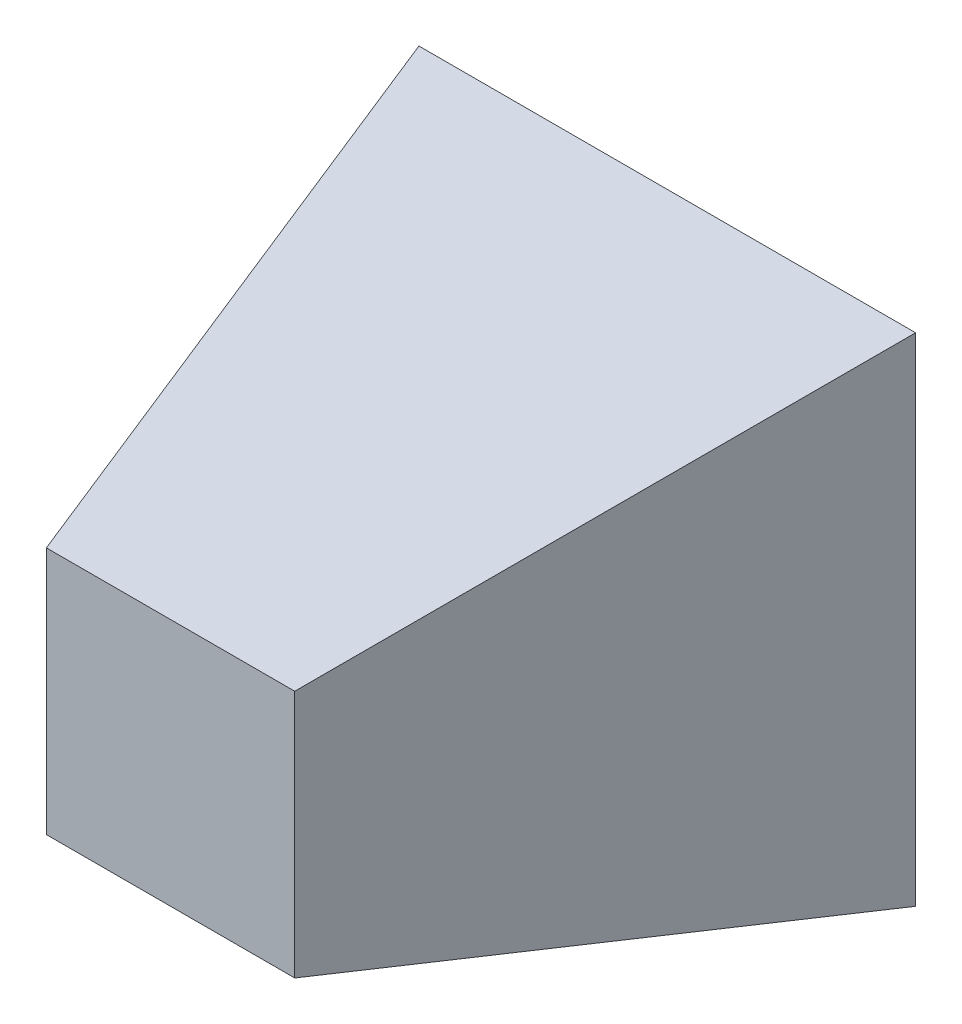
ISO-10303-21;
HEADER;
FILE_DESCRIPTION(('STEP AP214'),'2;1');
FILE_NAME('part.step','',(''),(''),'','','');
FILE_SCHEMA(('AUTOMOTIVE_DESIGN { 1 0 10303 214 1 1 1 1 }'));
ENDSEC;
DATA;
#1=APPLICATION_CONTEXT('core data for automotive mechanical design processes');
#2=APPLICATION_PROTOCOL_DEFINITION('international standard','automotive_design',2000,#1);
#3=PRODUCT_CONTEXT('',#1,'mechanical');
#4=PRODUCT('Part','Part','',(#3));
#5=PRODUCT_RELATED_PRODUCT_CATEGORY('part','',(#4));
#6=PRODUCT_DEFINITION_FORMATION('','',#4);
#7=PRODUCT_DEFINITION_CONTEXT('part definition',#1,'design');
#8=PRODUCT_DEFINITION('design','',#6,#7);
#9=PRODUCT_DEFINITION_SHAPE('','',#8);
#10=(LENGTH_UNIT() NAMED_UNIT(*) SI_UNIT(.MILLI.,.METRE.));
#11=(NAMED_UNIT(*) PLANE_ANGLE_UNIT() SI_UNIT($,.RADIAN.));
#12=(NAMED_UNIT(*) SI_UNIT($,.STERADIAN.) SOLID_ANGLE_UNIT());
#13=UNCERTAINTY_MEASURE_WITH_UNIT(LENGTH_MEASURE(1.E-05),#10,'distance_accuracy_value','');
#14=(GEOMETRIC_REPRESENTATION_CONTEXT(3) GLOBAL_UNCERTAINTY_ASSIGNED_CONTEXT((#13)) GLOBAL_UNIT_ASSIGNED_CONTEXT((#10,
#11,#12)) REPRESENTATION_CONTEXT('',''));
#15=CARTESIAN_POINT('',(0.,0.,0.));
#16=DIRECTION('',(0.,0.,1.));
#17=DIRECTION('',(1.,0.,0.));
#18=AXIS2_PLACEMENT_3D('',#15,#16,#17);
#19=CARTESIAN_POINT('',(0.,0.,100.));
#20=DIRECTION('',(0.,0.,1.));
#21=DIRECTION('',(1.,0.,0.));
#22=AXIS2_PLACEMENT_3D('',#19,#20,#21);
#23=PLANE('',#22);
#24=DIRECTION('',(0.,1.,0.));
#25=VECTOR('',#24,1.);
#26=CARTESIAN_POINT('',(25.,25.,100.));
#27=LINE('',#26,#25);
#28=CARTESIAN_POINT('',(25.,-25.,100.));
#29=VERTEX_POINT('',#28);
#30=CARTESIAN_POINT('',(25.,25.,100.));
#31=VERTEX_POINT('',#30);
#32=EDGE_CURVE('E173',#29,#31,#27,.T.);
#33=ORIENTED_EDGE('',*,*,#32,.T.);
#34=DIRECTION('',(-1.,0.,0.));
#35=VECTOR('',#34,1.);
#36=CARTESIAN_POINT('',(-25.,25.,100.));
#37=LINE('',#36,#35);
#38=CARTESIAN_POINT('',(-25.,25.,100.));
#39=VERTEX_POINT('',#38);
#40=EDGE_CURVE('E12',#31,#39,#37,.T.);
#41=ORIENTED_EDGE('',*,*,#40,.T.);
#42=DIRECTION('',(0.,-1.,0.));
#43=VECTOR('',#42,1.);
#44=CARTESIAN_POINT('',(-25.,25.,100.));
#45=LINE('',#44,#43);
#46=CARTESIAN_POINT('',(-25.,-25.,100.));
#47=VERTEX_POINT('',#46);
#48=EDGE_CURVE('E60',#39,#47,#45,.T.);
#49=ORIENTED_EDGE('',*,*,#48,.T.);
#50=DIRECTION('',(1.,0.,0.));
#51=VECTOR('',#50,1.);
#52=CARTESIAN_POINT('',(-25.,-25.,100.));
#53=LINE('',#52,#51);
#54=EDGE_CURVE('E193',#47,#29,#53,.T.);
#55=ORIENTED_EDGE('',*,*,#54,.T.);
#56=EDGE_LOOP('',(#33,#41,#49,#55));
#57=FACE_BOUND('',#56,.T.);
#58=ADVANCED_FACE('F49',(#57),#23,.T.);
#59=CARTESIAN_POINT('',(0.,0.,0.));
#60=DIRECTION('',(0.,0.,1.));
#61=DIRECTION('',(1.,0.,0.));
#62=AXIS2_PLACEMENT_3D('',#59,#60,#61);
#63=PLANE('',#62);
#64=DIRECTION('',(0.,1.,0.));
#65=VECTOR('',#64,1.);
#66=CARTESIAN_POINT('',(50.,50.,0.));
#67=LINE('',#66,#65);
#68=CARTESIAN_POINT('',(50.,-50.,0.));
#69=VERTEX_POINT('',#68);
#70=CARTESIAN_POINT('',(50.,50.,0.));
#71=VERTEX_POINT('',#70);
#72=EDGE_CURVE('E161',#69,#71,#67,.T.);
#73=ORIENTED_EDGE('',*,*,#72,.F.);
#74=DIRECTION('',(1.,0.,0.));
#75=VECTOR('',#74,1.);
#76=CARTESIAN_POINT('',(-50.,-50.,0.));
#77=LINE('',#76,#75);
#78=CARTESIAN_POINT('',(-50.,-50.,0.));
#79=VERTEX_POINT('',#78);
#80=EDGE_CURVE('E120',#79,#69,#77,.T.);
#81=ORIENTED_EDGE('',*,*,#80,.F.);
#82=DIRECTION('',(0.,-1.,0.));
#83=VECTOR('',#82,1.);
#84=CARTESIAN_POINT('',(-50.,50.,0.));
#85=LINE('',#84,#83);
#86=CARTESIAN_POINT('',(-50.,50.,0.));
#87=VERTEX_POINT('',#86);
#88=EDGE_CURVE('E99',#87,#79,#85,.T.);
#89=ORIENTED_EDGE('',*,*,#88,.F.);
#90=DIRECTION('',(-1.,0.,0.));
#91=VECTOR('',#90,1.);
#92=CARTESIAN_POINT('',(-50.,50.,0.));
#93=LINE('',#92,#91);
#94=EDGE_CURVE('E108',#71,#87,#93,.T.);
#95=ORIENTED_EDGE('',*,*,#94,.F.);
#96=EDGE_LOOP('',(#73,#81,#89,#95));
#97=FACE_BOUND('',#96,.T.);
#98=ADVANCED_FACE('F119',(#97),#63,.F.);
#99=CARTESIAN_POINT('',(-47.0588235294118,0.,11.7647058823529));
#100=DIRECTION('',(0.970142500145332,0.,-0.242535625036333));
#101=DIRECTION('',(-0.242535625036333,0.,-0.970142500145332));
#102=AXIS2_PLACEMENT_3D('',#99,#100,#101);
#103=PLANE('',#102);
#104=DIRECTION('',(0.235702260395516,0.235702260395516,0.942809041582063));
#105=VECTOR('',#104,1.);
#106=CARTESIAN_POINT('',(-50.,-50.,0.));
#107=LINE('',#106,#105);
#108=EDGE_CURVE('E106',#79,#47,#107,.T.);
#109=ORIENTED_EDGE('',*,*,#108,.T.);
#110=ORIENTED_EDGE('',*,*,#48,.F.);
#111=DIRECTION('',(0.235702260395516,-0.235702260395516,0.942809041582063));
#112=VECTOR('',#111,1.);
#113=CARTESIAN_POINT('',(-50.,50.,0.));
#114=LINE('',#113,#112);
#115=EDGE_CURVE('E94',#87,#39,#114,.T.);
#116=ORIENTED_EDGE('',*,*,#115,.F.);
#117=ORIENTED_EDGE('',*,*,#88,.T.);
#118=EDGE_LOOP('',(#109,#110,#116,#117));
#119=FACE_BOUND('',#118,.T.);
#120=ADVANCED_FACE('F97',(#119),#103,.F.);
#121=CARTESIAN_POINT('',(0.,47.0588235294118,11.7647058823529));
#122=DIRECTION('',(0.,-0.970142500145332,-0.242535625036333));
#123=DIRECTION('',(0.,0.242535625036333,-0.970142500145332));
#124=AXIS2_PLACEMENT_3D('',#121,#122,#123);
#125=PLANE('',#124);
#126=ORIENTED_EDGE('',*,*,#115,.T.);
#127=ORIENTED_EDGE('',*,*,#40,.F.);
#128=DIRECTION('',(-0.235702260395516,-0.235702260395516,0.942809041582063));
#129=VECTOR('',#128,1.);
#130=CARTESIAN_POINT('',(50.,50.,0.));
#131=LINE('',#130,#129);
#132=EDGE_CURVE('E68',#71,#31,#131,.T.);
#133=ORIENTED_EDGE('',*,*,#132,.F.);
#134=ORIENTED_EDGE('',*,*,#94,.T.);
#135=EDGE_LOOP('',(#126,#127,#133,#134));
#136=FACE_BOUND('',#135,.T.);
#137=ADVANCED_FACE('F110',(#136),#125,.F.);
#138=CARTESIAN_POINT('',(0.,-47.0588235294118,11.7647058823529));
#139=DIRECTION('',(0.,0.970142500145332,-0.242535625036333));
#140=DIRECTION('',(0.,0.242535625036333,0.970142500145332));
#141=AXIS2_PLACEMENT_3D('',#138,#139,#140);
#142=PLANE('',#141);
#143=DIRECTION('',(-0.235702260395516,0.235702260395516,0.942809041582063));
#144=VECTOR('',#143,1.);
#145=CARTESIAN_POINT('',(50.,-50.,0.));
#146=LINE('',#145,#144);
#147=EDGE_CURVE('E105',#69,#29,#146,.T.);
#148=ORIENTED_EDGE('',*,*,#147,.T.);
#149=ORIENTED_EDGE('',*,*,#54,.F.);
#150=ORIENTED_EDGE('',*,*,#108,.F.);
#151=ORIENTED_EDGE('',*,*,#80,.T.);
#152=EDGE_LOOP('',(#148,#149,#150,#151));
#153=FACE_BOUND('',#152,.T.);
#154=ADVANCED_FACE('F231',(#153),#142,.F.);
#155=CARTESIAN_POINT('',(47.0588235294118,0.,11.7647058823529));
#156=DIRECTION('',(-0.970142500145332,0.,-0.242535625036333));
#157=DIRECTION('',(-0.242535625036333,0.,0.970142500145332));
#158=AXIS2_PLACEMENT_3D('',#155,#156,#157);
#159=PLANE('',#158);
#160=ORIENTED_EDGE('',*,*,#132,.T.);
#161=ORIENTED_EDGE('',*,*,#32,.F.);
#162=ORIENTED_EDGE('',*,*,#147,.F.);
#163=ORIENTED_EDGE('',*,*,#72,.T.);
#164=EDGE_LOOP('',(#160,#161,#162,#163));
#165=FACE_BOUND('',#164,.T.);
#166=ADVANCED_FACE('F239',(#165),#159,.F.);
#167=CLOSED_SHELL('',(#58,#98,#120,#137,#154,#166));
#168=MANIFOLD_SOLID_BREP('B2',#167);
#169=ADVANCED_BREP_SHAPE_REPRESENTATION('',(#18,#168),#14);
#170=SHAPE_DEFINITION_REPRESENTATION(#9,#169);
ENDSEC;
END-ISO-10303-21;
